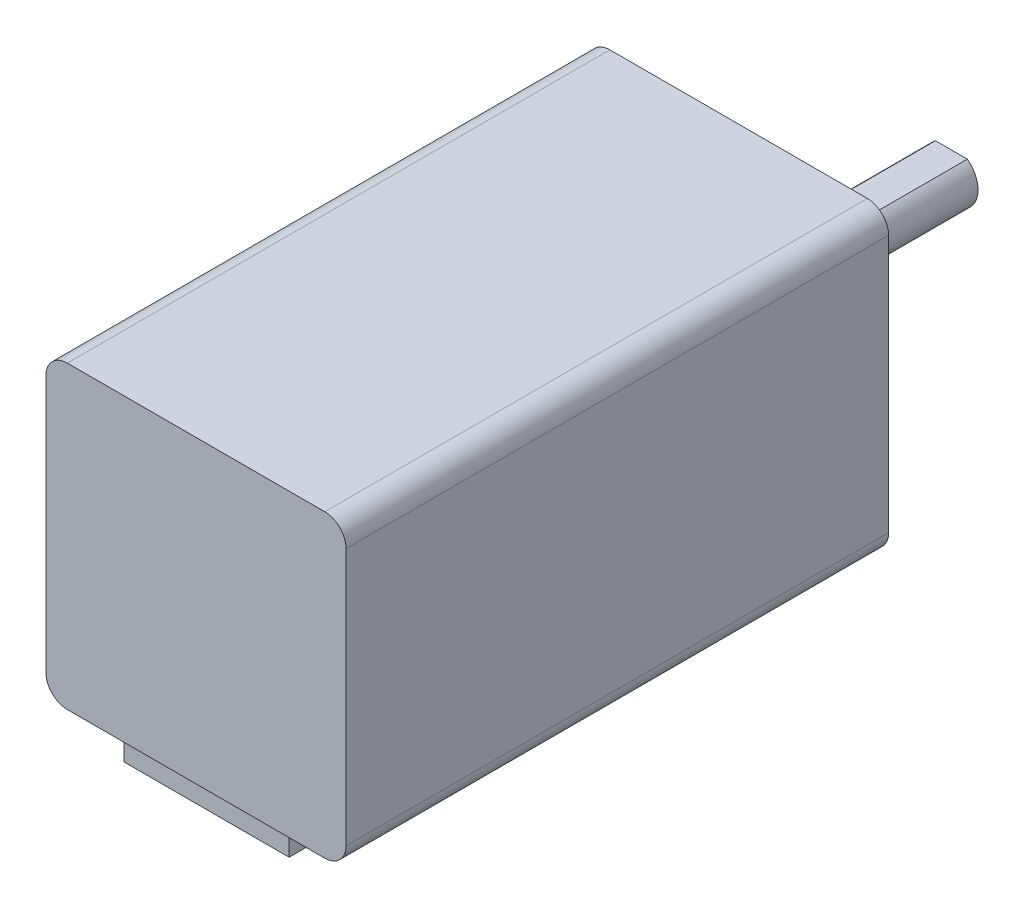
ISO-10303-21;
HEADER;
FILE_DESCRIPTION(('STEP AP214'),'2;1');
FILE_NAME('part.step','',(''),(''),'','','');
FILE_SCHEMA(('AUTOMOTIVE_DESIGN { 1 0 10303 214 1 1 1 1 }'));
ENDSEC;
DATA;
#1=APPLICATION_CONTEXT('core data for automotive mechanical design processes');
#2=APPLICATION_PROTOCOL_DEFINITION('international standard','automotive_design',2000,#1);
#3=PRODUCT_CONTEXT('',#1,'mechanical');
#4=PRODUCT('Part','Part','',(#3));
#5=PRODUCT_RELATED_PRODUCT_CATEGORY('part','',(#4));
#6=PRODUCT_DEFINITION_FORMATION('','',#4);
#7=PRODUCT_DEFINITION_CONTEXT('part definition',#1,'design');
#8=PRODUCT_DEFINITION('design','',#6,#7);
#9=PRODUCT_DEFINITION_SHAPE('','',#8);
#10=(LENGTH_UNIT() NAMED_UNIT(*) SI_UNIT(.MILLI.,.METRE.));
#11=(NAMED_UNIT(*) PLANE_ANGLE_UNIT() SI_UNIT($,.RADIAN.));
#12=(NAMED_UNIT(*) SI_UNIT($,.STERADIAN.) SOLID_ANGLE_UNIT());
#13=UNCERTAINTY_MEASURE_WITH_UNIT(LENGTH_MEASURE(1.E-05),#10,'distance_accuracy_value','');
#14=(GEOMETRIC_REPRESENTATION_CONTEXT(3) GLOBAL_UNCERTAINTY_ASSIGNED_CONTEXT((#13)) GLOBAL_UNIT_ASSIGNED_CONTEXT((#10,
#11,#12)) REPRESENTATION_CONTEXT('',''));
#15=CARTESIAN_POINT('',(0.,0.,0.));
#16=DIRECTION('',(0.,0.,1.));
#17=DIRECTION('',(1.,0.,0.));
#18=AXIS2_PLACEMENT_3D('',#15,#16,#17);
#19=CARTESIAN_POINT('',(-14.1,0.,51.));
#20=DIRECTION('',(-1.,0.,0.));
#21=DIRECTION('',(0.,0.,1.));
#22=AXIS2_PLACEMENT_3D('',#19,#20,#21);
#23=PLANE('',#22);
#24=DIRECTION('',(0.,1.,0.));
#25=VECTOR('',#24,1.);
#26=CARTESIAN_POINT('',(-14.1,0.,0.));
#27=LINE('',#26,#25);
#28=CARTESIAN_POINT('',(-14.1,-12.1,0.));
#29=VERTEX_POINT('',#28);
#30=CARTESIAN_POINT('',(-14.1,12.1,0.));
#31=VERTEX_POINT('',#30);
#32=EDGE_CURVE('E276',#29,#31,#27,.T.);
#33=ORIENTED_EDGE('',*,*,#32,.F.);
#34=DIRECTION('',(0.,0.,-1.));
#35=VECTOR('',#34,1.);
#36=CARTESIAN_POINT('',(-14.1,-12.1,51.));
#37=LINE('',#36,#35);
#38=CARTESIAN_POINT('',(-14.1,-12.1,51.));
#39=VERTEX_POINT('',#38);
#40=EDGE_CURVE('E307',#39,#29,#37,.T.);
#41=ORIENTED_EDGE('',*,*,#40,.F.);
#42=DIRECTION('',(0.,1.,0.));
#43=VECTOR('',#42,1.);
#44=CARTESIAN_POINT('',(-14.1,0.,51.));
#45=LINE('',#44,#43);
#46=CARTESIAN_POINT('',(-14.1,12.1,51.));
#47=VERTEX_POINT('',#46);
#48=EDGE_CURVE('E255',#39,#47,#45,.T.);
#49=ORIENTED_EDGE('',*,*,#48,.T.);
#50=DIRECTION('',(0.,0.,-1.));
#51=VECTOR('',#50,1.);
#52=CARTESIAN_POINT('',(-14.1,12.1,51.));
#53=LINE('',#52,#51);
#54=EDGE_CURVE('E76',#47,#31,#53,.T.);
#55=ORIENTED_EDGE('',*,*,#54,.T.);
#56=EDGE_LOOP('',(#33,#41,#49,#55));
#57=FACE_BOUND('',#56,.T.);
#58=ADVANCED_FACE('F68',(#57),#23,.T.);
#59=CARTESIAN_POINT('',(-12.1,-12.1,51.));
#60=DIRECTION('',(0.,0.,-1.));
#61=DIRECTION('',(-1.,0.,0.));
#62=AXIS2_PLACEMENT_3D('',#59,#60,#61);
#63=CYLINDRICAL_SURFACE('',#62,2.);
#64=CARTESIAN_POINT('',(-12.1,-12.1,0.));
#65=DIRECTION('',(0.,0.,1.));
#66=DIRECTION('',(1.,0.,0.));
#67=AXIS2_PLACEMENT_3D('',#64,#65,#66);
#68=CIRCLE('',#67,2.);
#69=CARTESIAN_POINT('',(-12.1,-14.1,0.));
#70=VERTEX_POINT('',#69);
#71=EDGE_CURVE('E279',#70,#29,#68,.F.);
#72=ORIENTED_EDGE('',*,*,#71,.F.);
#73=DIRECTION('',(0.,0.,-1.));
#74=VECTOR('',#73,1.);
#75=CARTESIAN_POINT('',(-12.1,-14.1,51.));
#76=LINE('',#75,#74);
#77=CARTESIAN_POINT('',(-12.1,-14.1,51.));
#78=VERTEX_POINT('',#77);
#79=EDGE_CURVE('E305',#78,#70,#76,.T.);
#80=ORIENTED_EDGE('',*,*,#79,.F.);
#81=CARTESIAN_POINT('',(-12.1,-12.1,51.));
#82=DIRECTION('',(0.,0.,1.));
#83=DIRECTION('',(1.,0.,0.));
#84=AXIS2_PLACEMENT_3D('',#81,#82,#83);
#85=CIRCLE('',#84,2.);
#86=EDGE_CURVE('E259',#78,#39,#85,.F.);
#87=ORIENTED_EDGE('',*,*,#86,.T.);
#88=ORIENTED_EDGE('',*,*,#40,.T.);
#89=EDGE_LOOP('',(#72,#80,#87,#88));
#90=FACE_BOUND('',#89,.T.);
#91=ADVANCED_FACE('F321',(#90),#63,.T.);
#92=CARTESIAN_POINT('',(0.,-14.1,51.));
#93=DIRECTION('',(0.,1.,0.));
#94=DIRECTION('',(0.,0.,1.));
#95=AXIS2_PLACEMENT_3D('',#92,#93,#94);
#96=PLANE('',#95);
#97=DIRECTION('',(0.,0.,-1.));
#98=VECTOR('',#97,1.);
#99=CARTESIAN_POINT('',(-7.75,-14.1,50.));
#100=LINE('',#99,#98);
#101=CARTESIAN_POINT('',(-7.75,-14.1,50.));
#102=VERTEX_POINT('',#101);
#103=CARTESIAN_POINT('',(-7.75,-14.1,44.));
#104=VERTEX_POINT('',#103);
#105=EDGE_CURVE('E83',#102,#104,#100,.T.);
#106=ORIENTED_EDGE('',*,*,#105,.F.);
#107=DIRECTION('',(-1.,0.,0.));
#108=VECTOR('',#107,1.);
#109=CARTESIAN_POINT('',(7.75,-14.1,50.));
#110=LINE('',#109,#108);
#111=CARTESIAN_POINT('',(7.75,-14.1,50.));
#112=VERTEX_POINT('',#111);
#113=EDGE_CURVE('E87',#112,#102,#110,.T.);
#114=ORIENTED_EDGE('',*,*,#113,.F.);
#115=DIRECTION('',(0.,0.,-1.));
#116=VECTOR('',#115,1.);
#117=CARTESIAN_POINT('',(7.75,-14.1,50.));
#118=LINE('',#117,#116);
#119=CARTESIAN_POINT('',(7.75,-14.1,44.));
#120=VERTEX_POINT('',#119);
#121=EDGE_CURVE('E203',#112,#120,#118,.T.);
#122=ORIENTED_EDGE('',*,*,#121,.T.);
#123=DIRECTION('',(-1.,0.,0.));
#124=VECTOR('',#123,1.);
#125=CARTESIAN_POINT('',(7.75,-14.1,44.));
#126=LINE('',#125,#124);
#127=EDGE_CURVE('E194',#120,#104,#126,.T.);
#128=ORIENTED_EDGE('',*,*,#127,.T.);
#129=EDGE_LOOP('',(#106,#114,#122,#128));
#130=FACE_BOUND('',#129,.T.);
#131=DIRECTION('',(1.,0.,0.));
#132=VECTOR('',#131,1.);
#133=CARTESIAN_POINT('',(0.,-14.1,0.));
#134=LINE('',#133,#132);
#135=CARTESIAN_POINT('',(12.1,-14.1,0.));
#136=VERTEX_POINT('',#135);
#137=EDGE_CURVE('E282',#70,#136,#134,.T.);
#138=ORIENTED_EDGE('',*,*,#137,.T.);
#139=DIRECTION('',(0.,0.,-1.));
#140=VECTOR('',#139,1.);
#141=CARTESIAN_POINT('',(12.1,-14.1,51.));
#142=LINE('',#141,#140);
#143=CARTESIAN_POINT('',(12.1,-14.1,51.));
#144=VERTEX_POINT('',#143);
#145=EDGE_CURVE('E302',#144,#136,#142,.T.);
#146=ORIENTED_EDGE('',*,*,#145,.F.);
#147=DIRECTION('',(1.,0.,0.));
#148=VECTOR('',#147,1.);
#149=CARTESIAN_POINT('',(0.,-14.1,51.));
#150=LINE('',#149,#148);
#151=EDGE_CURVE('E262',#78,#144,#150,.T.);
#152=ORIENTED_EDGE('',*,*,#151,.F.);
#153=ORIENTED_EDGE('',*,*,#79,.T.);
#154=EDGE_LOOP('',(#138,#146,#152,#153));
#155=FACE_BOUND('',#154,.T.);
#156=ADVANCED_FACE('F345',(#130,#155),#96,.F.);
#157=CARTESIAN_POINT('',(12.1,-12.1,51.));
#158=DIRECTION('',(0.,0.,-1.));
#159=DIRECTION('',(-1.,0.,0.));
#160=AXIS2_PLACEMENT_3D('',#157,#158,#159);
#161=CYLINDRICAL_SURFACE('',#160,2.);
#162=CARTESIAN_POINT('',(12.1,-12.1,0.));
#163=DIRECTION('',(0.,0.,1.));
#164=DIRECTION('',(1.,0.,0.));
#165=AXIS2_PLACEMENT_3D('',#162,#163,#164);
#166=CIRCLE('',#165,2.);
#167=CARTESIAN_POINT('',(14.1,-12.1,0.));
#168=VERTEX_POINT('',#167);
#169=EDGE_CURVE('E284',#136,#168,#166,.T.);
#170=ORIENTED_EDGE('',*,*,#169,.T.);
#171=DIRECTION('',(0.,0.,-1.));
#172=VECTOR('',#171,1.);
#173=CARTESIAN_POINT('',(14.1,-12.1,51.));
#174=LINE('',#173,#172);
#175=CARTESIAN_POINT('',(14.1,-12.1,51.));
#176=VERTEX_POINT('',#175);
#177=EDGE_CURVE('E299',#176,#168,#174,.T.);
#178=ORIENTED_EDGE('',*,*,#177,.F.);
#179=CARTESIAN_POINT('',(12.1,-12.1,51.));
#180=DIRECTION('',(0.,0.,1.));
#181=DIRECTION('',(1.,0.,0.));
#182=AXIS2_PLACEMENT_3D('',#179,#180,#181);
#183=CIRCLE('',#182,2.);
#184=EDGE_CURVE('E264',#144,#176,#183,.T.);
#185=ORIENTED_EDGE('',*,*,#184,.F.);
#186=ORIENTED_EDGE('',*,*,#145,.T.);
#187=EDGE_LOOP('',(#170,#178,#185,#186));
#188=FACE_BOUND('',#187,.T.);
#189=ADVANCED_FACE('F342',(#188),#161,.T.);
#190=CARTESIAN_POINT('',(14.1,0.,51.));
#191=DIRECTION('',(-1.,0.,0.));
#192=DIRECTION('',(0.,0.,1.));
#193=AXIS2_PLACEMENT_3D('',#190,#191,#192);
#194=PLANE('',#193);
#195=DIRECTION('',(0.,1.,0.));
#196=VECTOR('',#195,1.);
#197=CARTESIAN_POINT('',(14.1,0.,0.));
#198=LINE('',#197,#196);
#199=CARTESIAN_POINT('',(14.1,12.1,0.));
#200=VERTEX_POINT('',#199);
#201=EDGE_CURVE('E286',#168,#200,#198,.T.);
#202=ORIENTED_EDGE('',*,*,#201,.T.);
#203=DIRECTION('',(0.,0.,-1.));
#204=VECTOR('',#203,1.);
#205=CARTESIAN_POINT('',(14.1,12.1,51.));
#206=LINE('',#205,#204);
#207=CARTESIAN_POINT('',(14.1,12.1,51.));
#208=VERTEX_POINT('',#207);
#209=EDGE_CURVE('E296',#208,#200,#206,.T.);
#210=ORIENTED_EDGE('',*,*,#209,.F.);
#211=DIRECTION('',(0.,1.,0.));
#212=VECTOR('',#211,1.);
#213=CARTESIAN_POINT('',(14.1,0.,51.));
#214=LINE('',#213,#212);
#215=EDGE_CURVE('E266',#176,#208,#214,.T.);
#216=ORIENTED_EDGE('',*,*,#215,.F.);
#217=ORIENTED_EDGE('',*,*,#177,.T.);
#218=EDGE_LOOP('',(#202,#210,#216,#217));
#219=FACE_BOUND('',#218,.T.);
#220=ADVANCED_FACE('F338',(#219),#194,.F.);
#221=CARTESIAN_POINT('',(12.1,12.1,51.));
#222=DIRECTION('',(0.,0.,-1.));
#223=DIRECTION('',(-1.,0.,0.));
#224=AXIS2_PLACEMENT_3D('',#221,#222,#223);
#225=CYLINDRICAL_SURFACE('',#224,2.);
#226=CARTESIAN_POINT('',(12.1,12.1,0.));
#227=DIRECTION('',(0.,0.,1.));
#228=DIRECTION('',(1.,0.,0.));
#229=AXIS2_PLACEMENT_3D('',#226,#227,#228);
#230=CIRCLE('',#229,2.);
#231=CARTESIAN_POINT('',(12.1,14.1,0.));
#232=VERTEX_POINT('',#231);
#233=EDGE_CURVE('E288',#200,#232,#230,.T.);
#234=ORIENTED_EDGE('',*,*,#233,.T.);
#235=DIRECTION('',(0.,0.,-1.));
#236=VECTOR('',#235,1.);
#237=CARTESIAN_POINT('',(12.1,14.1,51.));
#238=LINE('',#237,#236);
#239=CARTESIAN_POINT('',(12.1,14.1,51.));
#240=VERTEX_POINT('',#239);
#241=EDGE_CURVE('E294',#240,#232,#238,.T.);
#242=ORIENTED_EDGE('',*,*,#241,.F.);
#243=CARTESIAN_POINT('',(12.1,12.1,51.));
#244=DIRECTION('',(0.,0.,1.));
#245=DIRECTION('',(1.,0.,0.));
#246=AXIS2_PLACEMENT_3D('',#243,#244,#245);
#247=CIRCLE('',#246,2.);
#248=EDGE_CURVE('E268',#208,#240,#247,.T.);
#249=ORIENTED_EDGE('',*,*,#248,.F.);
#250=ORIENTED_EDGE('',*,*,#209,.T.);
#251=EDGE_LOOP('',(#234,#242,#249,#250));
#252=FACE_BOUND('',#251,.T.);
#253=ADVANCED_FACE('F334',(#252),#225,.T.);
#254=CARTESIAN_POINT('',(0.,14.1,51.));
#255=DIRECTION('',(0.,1.,0.));
#256=DIRECTION('',(0.,0.,1.));
#257=AXIS2_PLACEMENT_3D('',#254,#255,#256);
#258=PLANE('',#257);
#259=DIRECTION('',(1.,0.,0.));
#260=VECTOR('',#259,1.);
#261=CARTESIAN_POINT('',(0.,14.1,0.));
#262=LINE('',#261,#260);
#263=CARTESIAN_POINT('',(-12.1,14.1,0.));
#264=VERTEX_POINT('',#263);
#265=EDGE_CURVE('E256',#264,#232,#262,.T.);
#266=ORIENTED_EDGE('',*,*,#265,.F.);
#267=DIRECTION('',(0.,0.,-1.));
#268=VECTOR('',#267,1.);
#269=CARTESIAN_POINT('',(-12.1,14.1,51.));
#270=LINE('',#269,#268);
#271=CARTESIAN_POINT('',(-12.1,14.1,51.));
#272=VERTEX_POINT('',#271);
#273=EDGE_CURVE('E273',#272,#264,#270,.T.);
#274=ORIENTED_EDGE('',*,*,#273,.F.);
#275=DIRECTION('',(1.,0.,0.));
#276=VECTOR('',#275,1.);
#277=CARTESIAN_POINT('',(0.,14.1,51.));
#278=LINE('',#277,#276);
#279=EDGE_CURVE('E270',#272,#240,#278,.T.);
#280=ORIENTED_EDGE('',*,*,#279,.T.);
#281=ORIENTED_EDGE('',*,*,#241,.T.);
#282=EDGE_LOOP('',(#266,#274,#280,#281));
#283=FACE_BOUND('',#282,.T.);
#284=ADVANCED_FACE('F330',(#283),#258,.T.);
#285=CARTESIAN_POINT('',(-12.1,12.1,51.));
#286=DIRECTION('',(0.,0.,-1.));
#287=DIRECTION('',(-1.,0.,0.));
#288=AXIS2_PLACEMENT_3D('',#285,#286,#287);
#289=CYLINDRICAL_SURFACE('',#288,2.);
#290=CARTESIAN_POINT('',(-12.1,12.1,0.));
#291=DIRECTION('',(0.,0.,1.));
#292=DIRECTION('',(1.,0.,0.));
#293=AXIS2_PLACEMENT_3D('',#290,#291,#292);
#294=CIRCLE('',#293,2.);
#295=EDGE_CURVE('E251',#31,#264,#294,.F.);
#296=ORIENTED_EDGE('',*,*,#295,.F.);
#297=ORIENTED_EDGE('',*,*,#54,.F.);
#298=CARTESIAN_POINT('',(-12.1,12.1,51.));
#299=DIRECTION('',(0.,0.,1.));
#300=DIRECTION('',(1.,0.,0.));
#301=AXIS2_PLACEMENT_3D('',#298,#299,#300);
#302=CIRCLE('',#301,2.);
#303=EDGE_CURVE('E252',#47,#272,#302,.F.);
#304=ORIENTED_EDGE('',*,*,#303,.T.);
#305=ORIENTED_EDGE('',*,*,#273,.T.);
#306=EDGE_LOOP('',(#296,#297,#304,#305));
#307=FACE_BOUND('',#306,.T.);
#308=ADVANCED_FACE('F70',(#307),#289,.T.);
#309=CARTESIAN_POINT('',(0.,0.,0.));
#310=DIRECTION('',(0.,0.,1.));
#311=DIRECTION('',(1.,0.,0.));
#312=AXIS2_PLACEMENT_3D('',#309,#310,#311);
#313=PLANE('',#312);
#314=CARTESIAN_POINT('',(0.,0.,0.));
#315=DIRECTION('',(0.,0.,1.));
#316=DIRECTION('',(1.,0.,0.));
#317=AXIS2_PLACEMENT_3D('',#314,#315,#316);
#318=CIRCLE('',#317,11.);
#319=CARTESIAN_POINT('',(11.,0.,0.));
#320=VERTEX_POINT('',#319);
#321=EDGE_CURVE('E221',#320,#320,#318,.T.);
#322=ORIENTED_EDGE('',*,*,#321,.T.);
#323=EDGE_LOOP('',(#322));
#324=FACE_BOUND('',#323,.T.);
#325=CARTESIAN_POINT('',(11.5,11.5,0.));
#326=DIRECTION('',(0.,0.,-1.));
#327=DIRECTION('',(-1.,0.,0.));
#328=AXIS2_PLACEMENT_3D('',#325,#326,#327);
#329=CIRCLE('',#328,1.02499999999999);
#330=CARTESIAN_POINT('',(10.475,11.5,0.));
#331=VERTEX_POINT('',#330);
#332=EDGE_CURVE('E225',#331,#331,#329,.T.);
#333=ORIENTED_EDGE('',*,*,#332,.F.);
#334=EDGE_LOOP('',(#333));
#335=FACE_BOUND('',#334,.T.);
#336=CARTESIAN_POINT('',(-11.5,11.5,0.));
#337=DIRECTION('',(0.,0.,-1.));
#338=DIRECTION('',(-1.,0.,0.));
#339=AXIS2_PLACEMENT_3D('',#336,#337,#338);
#340=CIRCLE('',#339,1.02499999999999);
#341=CARTESIAN_POINT('',(-12.525,11.5,0.));
#342=VERTEX_POINT('',#341);
#343=EDGE_CURVE('E233',#342,#342,#340,.T.);
#344=ORIENTED_EDGE('',*,*,#343,.F.);
#345=EDGE_LOOP('',(#344));
#346=FACE_BOUND('',#345,.T.);
#347=CARTESIAN_POINT('',(-11.5,-11.5,0.));
#348=DIRECTION('',(0.,0.,-1.));
#349=DIRECTION('',(-1.,0.,0.));
#350=AXIS2_PLACEMENT_3D('',#347,#348,#349);
#351=CIRCLE('',#350,1.02499999999999);
#352=CARTESIAN_POINT('',(-12.525,-11.5,0.));
#353=VERTEX_POINT('',#352);
#354=EDGE_CURVE('E239',#353,#353,#351,.T.);
#355=ORIENTED_EDGE('',*,*,#354,.F.);
#356=EDGE_LOOP('',(#355));
#357=FACE_BOUND('',#356,.T.);
#358=CARTESIAN_POINT('',(11.5,-11.5,0.));
#359=DIRECTION('',(0.,0.,-1.));
#360=DIRECTION('',(-1.,0.,0.));
#361=AXIS2_PLACEMENT_3D('',#358,#359,#360);
#362=CIRCLE('',#361,1.02499999999999);
#363=CARTESIAN_POINT('',(10.475,-11.5,0.));
#364=VERTEX_POINT('',#363);
#365=EDGE_CURVE('E245',#364,#364,#362,.T.);
#366=ORIENTED_EDGE('',*,*,#365,.F.);
#367=EDGE_LOOP('',(#366));
#368=FACE_BOUND('',#367,.T.);
#369=ORIENTED_EDGE('',*,*,#295,.T.);
#370=ORIENTED_EDGE('',*,*,#265,.T.);
#371=ORIENTED_EDGE('',*,*,#233,.F.);
#372=ORIENTED_EDGE('',*,*,#201,.F.);
#373=ORIENTED_EDGE('',*,*,#169,.F.);
#374=ORIENTED_EDGE('',*,*,#137,.F.);
#375=ORIENTED_EDGE('',*,*,#71,.T.);
#376=ORIENTED_EDGE('',*,*,#32,.T.);
#377=EDGE_LOOP('',(#369,#370,#371,#372,#373,#374,#375,#376));
#378=FACE_BOUND('',#377,.T.);
#379=ADVANCED_FACE('F316',(#324,#335,#346,#357,#368,#378),#313,.F.);
#380=CARTESIAN_POINT('',(0.,0.,51.));
#381=DIRECTION('',(0.,0.,1.));
#382=DIRECTION('',(1.,0.,0.));
#383=AXIS2_PLACEMENT_3D('',#380,#381,#382);
#384=PLANE('',#383);
#385=ORIENTED_EDGE('',*,*,#303,.F.);
#386=ORIENTED_EDGE('',*,*,#48,.F.);
#387=ORIENTED_EDGE('',*,*,#86,.F.);
#388=ORIENTED_EDGE('',*,*,#151,.T.);
#389=ORIENTED_EDGE('',*,*,#184,.T.);
#390=ORIENTED_EDGE('',*,*,#215,.T.);
#391=ORIENTED_EDGE('',*,*,#248,.T.);
#392=ORIENTED_EDGE('',*,*,#279,.F.);
#393=EDGE_LOOP('',(#385,#386,#387,#388,#389,#390,#391,#392));
#394=FACE_BOUND('',#393,.T.);
#395=ADVANCED_FACE('F325',(#394),#384,.T.);
#396=CARTESIAN_POINT('',(11.5,-11.5,4.75));
#397=DIRECTION('',(0.,0.,-1.));
#398=DIRECTION('',(-1.,0.,0.));
#399=AXIS2_PLACEMENT_3D('',#396,#397,#398);
#400=CONICAL_SURFACE('',#399,1.02499999999999,1.02974425867665);
#401=CARTESIAN_POINT('',(11.5,-11.5,5.36588213450325));
#402=VERTEX_POINT('',#401);
#403=VERTEX_LOOP('',#402);
#404=FACE_BOUND('',#403,.T.);
#405=CARTESIAN_POINT('',(11.5,-11.5,4.75));
#406=DIRECTION('',(0.,0.,-1.));
#407=DIRECTION('',(-1.,0.,0.));
#408=AXIS2_PLACEMENT_3D('',#405,#406,#407);
#409=CIRCLE('',#408,1.02499999999999);
#410=CARTESIAN_POINT('',(10.475,-11.5,4.75));
#411=VERTEX_POINT('',#410);
#412=EDGE_CURVE('E248',#411,#411,#409,.T.);
#413=ORIENTED_EDGE('',*,*,#412,.T.);
#414=EDGE_LOOP('',(#413));
#415=FACE_BOUND('',#414,.T.);
#416=ADVANCED_FACE('F410',(#404,#415),#400,.F.);
#417=CARTESIAN_POINT('',(11.5,-11.5,0.));
#418=DIRECTION('',(0.,0.,-1.));
#419=DIRECTION('',(-1.,0.,0.));
#420=AXIS2_PLACEMENT_3D('',#417,#418,#419);
#421=CYLINDRICAL_SURFACE('',#420,1.02499999999999);
#422=ORIENTED_EDGE('',*,*,#412,.F.);
#423=EDGE_LOOP('',(#422));
#424=FACE_BOUND('',#423,.T.);
#425=ORIENTED_EDGE('',*,*,#365,.T.);
#426=EDGE_LOOP('',(#425));
#427=FACE_BOUND('',#426,.T.);
#428=ADVANCED_FACE('F419',(#424,#427),#421,.F.);
#429=CARTESIAN_POINT('',(-11.5,-11.5,4.75));
#430=DIRECTION('',(0.,0.,-1.));
#431=DIRECTION('',(-1.,0.,0.));
#432=AXIS2_PLACEMENT_3D('',#429,#430,#431);
#433=CONICAL_SURFACE('',#432,1.02499999999999,1.02974425867665);
#434=CARTESIAN_POINT('',(-11.5,-11.5,5.36588213450325));
#435=VERTEX_POINT('',#434);
#436=VERTEX_LOOP('',#435);
#437=FACE_BOUND('',#436,.T.);
#438=CARTESIAN_POINT('',(-11.5,-11.5,4.75));
#439=DIRECTION('',(0.,0.,-1.));
#440=DIRECTION('',(-1.,0.,0.));
#441=AXIS2_PLACEMENT_3D('',#438,#439,#440);
#442=CIRCLE('',#441,1.02499999999999);
#443=CARTESIAN_POINT('',(-12.525,-11.5,4.75));
#444=VERTEX_POINT('',#443);
#445=EDGE_CURVE('E242',#444,#444,#442,.T.);
#446=ORIENTED_EDGE('',*,*,#445,.T.);
#447=EDGE_LOOP('',(#446));
#448=FACE_BOUND('',#447,.T.);
#449=ADVANCED_FACE('F430',(#437,#448),#433,.F.);
#450=CARTESIAN_POINT('',(-11.5,-11.5,0.));
#451=DIRECTION('',(0.,0.,-1.));
#452=DIRECTION('',(-1.,0.,0.));
#453=AXIS2_PLACEMENT_3D('',#450,#451,#452);
#454=CYLINDRICAL_SURFACE('',#453,1.02499999999999);
#455=ORIENTED_EDGE('',*,*,#445,.F.);
#456=EDGE_LOOP('',(#455));
#457=FACE_BOUND('',#456,.T.);
#458=ORIENTED_EDGE('',*,*,#354,.T.);
#459=EDGE_LOOP('',(#458));
#460=FACE_BOUND('',#459,.T.);
#461=ADVANCED_FACE('F442',(#457,#460),#454,.F.);
#462=CARTESIAN_POINT('',(-11.5,11.5,4.75));
#463=DIRECTION('',(0.,0.,-1.));
#464=DIRECTION('',(-1.,0.,0.));
#465=AXIS2_PLACEMENT_3D('',#462,#463,#464);
#466=CONICAL_SURFACE('',#465,1.02499999999999,1.02974425867665);
#467=CARTESIAN_POINT('',(-11.5,11.5,5.36588213450325));
#468=VERTEX_POINT('',#467);
#469=VERTEX_LOOP('',#468);
#470=FACE_BOUND('',#469,.T.);
#471=CARTESIAN_POINT('',(-11.5,11.5,4.75));
#472=DIRECTION('',(0.,0.,-1.));
#473=DIRECTION('',(-1.,0.,0.));
#474=AXIS2_PLACEMENT_3D('',#471,#472,#473);
#475=CIRCLE('',#474,1.02499999999999);
#476=CARTESIAN_POINT('',(-12.525,11.5,4.75));
#477=VERTEX_POINT('',#476);
#478=EDGE_CURVE('E236',#477,#477,#475,.T.);
#479=ORIENTED_EDGE('',*,*,#478,.T.);
#480=EDGE_LOOP('',(#479));
#481=FACE_BOUND('',#480,.T.);
#482=ADVANCED_FACE('F452',(#470,#481),#466,.F.);
#483=CARTESIAN_POINT('',(-11.5,11.5,0.));
#484=DIRECTION('',(0.,0.,-1.));
#485=DIRECTION('',(-1.,0.,0.));
#486=AXIS2_PLACEMENT_3D('',#483,#484,#485);
#487=CYLINDRICAL_SURFACE('',#486,1.02499999999999);
#488=ORIENTED_EDGE('',*,*,#478,.F.);
#489=EDGE_LOOP('',(#488));
#490=FACE_BOUND('',#489,.T.);
#491=ORIENTED_EDGE('',*,*,#343,.T.);
#492=EDGE_LOOP('',(#491));
#493=FACE_BOUND('',#492,.T.);
#494=ADVANCED_FACE('F464',(#490,#493),#487,.F.);
#495=CARTESIAN_POINT('',(11.5,11.5,4.75));
#496=DIRECTION('',(0.,0.,-1.));
#497=DIRECTION('',(-1.,0.,0.));
#498=AXIS2_PLACEMENT_3D('',#495,#496,#497);
#499=CONICAL_SURFACE('',#498,1.02499999999999,1.02974425867665);
#500=CARTESIAN_POINT('',(11.5,11.5,5.36588213450325));
#501=VERTEX_POINT('',#500);
#502=VERTEX_LOOP('',#501);
#503=FACE_BOUND('',#502,.T.);
#504=CARTESIAN_POINT('',(11.5,11.5,4.75));
#505=DIRECTION('',(0.,0.,-1.));
#506=DIRECTION('',(-1.,0.,0.));
#507=AXIS2_PLACEMENT_3D('',#504,#505,#506);
#508=CIRCLE('',#507,1.02499999999999);
#509=CARTESIAN_POINT('',(10.475,11.5,4.75));
#510=VERTEX_POINT('',#509);
#511=EDGE_CURVE('E230',#510,#510,#508,.T.);
#512=ORIENTED_EDGE('',*,*,#511,.T.);
#513=EDGE_LOOP('',(#512));
#514=FACE_BOUND('',#513,.T.);
#515=ADVANCED_FACE('F474',(#503,#514),#499,.F.);
#516=CARTESIAN_POINT('',(11.5,11.5,0.));
#517=DIRECTION('',(0.,0.,-1.));
#518=DIRECTION('',(-1.,0.,0.));
#519=AXIS2_PLACEMENT_3D('',#516,#517,#518);
#520=CYLINDRICAL_SURFACE('',#519,1.02499999999999);
#521=ORIENTED_EDGE('',*,*,#511,.F.);
#522=EDGE_LOOP('',(#521));
#523=FACE_BOUND('',#522,.T.);
#524=ORIENTED_EDGE('',*,*,#332,.T.);
#525=EDGE_LOOP('',(#524));
#526=FACE_BOUND('',#525,.T.);
#527=ADVANCED_FACE('F486',(#523,#526),#520,.F.);
#528=CARTESIAN_POINT('',(0.,0.,-2.));
#529=DIRECTION('',(0.,0.,1.));
#530=DIRECTION('',(1.,0.,0.));
#531=AXIS2_PLACEMENT_3D('',#528,#529,#530);
#532=CYLINDRICAL_SURFACE('',#531,11.);
#533=CARTESIAN_POINT('',(0.,0.,-2.));
#534=DIRECTION('',(0.,0.,1.));
#535=DIRECTION('',(1.,0.,0.));
#536=AXIS2_PLACEMENT_3D('',#533,#534,#535);
#537=CIRCLE('',#536,11.);
#538=CARTESIAN_POINT('',(11.,0.,-2.));
#539=VERTEX_POINT('',#538);
#540=EDGE_CURVE('E222',#539,#539,#537,.T.);
#541=ORIENTED_EDGE('',*,*,#540,.T.);
#542=EDGE_LOOP('',(#541));
#543=FACE_BOUND('',#542,.T.);
#544=ORIENTED_EDGE('',*,*,#321,.F.);
#545=EDGE_LOOP('',(#544));
#546=FACE_BOUND('',#545,.T.);
#547=ADVANCED_FACE('F496',(#543,#546),#532,.T.);
#548=CARTESIAN_POINT('',(0.,0.,-2.));
#549=DIRECTION('',(0.,0.,1.));
#550=DIRECTION('',(1.,0.,0.));
#551=AXIS2_PLACEMENT_3D('',#548,#549,#550);
#552=PLANE('',#551);
#553=CARTESIAN_POINT('',(0.,0.,-2.));
#554=DIRECTION('',(0.,0.,1.));
#555=DIRECTION('',(1.,0.,0.));
#556=AXIS2_PLACEMENT_3D('',#553,#554,#555);
#557=CIRCLE('',#556,2.5);
#558=CARTESIAN_POINT('',(2.5,0.,-2.));
#559=VERTEX_POINT('',#558);
#560=EDGE_CURVE('E218',#559,#559,#557,.T.);
#561=ORIENTED_EDGE('',*,*,#560,.T.);
#562=EDGE_LOOP('',(#561));
#563=FACE_BOUND('',#562,.T.);
#564=ORIENTED_EDGE('',*,*,#540,.F.);
#565=EDGE_LOOP('',(#564));
#566=FACE_BOUND('',#565,.T.);
#567=ADVANCED_FACE('F514',(#563,#566),#552,.F.);
#568=CARTESIAN_POINT('',(0.,0.,-20.));
#569=DIRECTION('',(0.,0.,1.));
#570=DIRECTION('',(1.,0.,0.));
#571=AXIS2_PLACEMENT_3D('',#568,#569,#570);
#572=CYLINDRICAL_SURFACE('',#571,2.5);
#573=DIRECTION('',(0.,0.,-1.));
#574=VECTOR('',#573,1.);
#575=CARTESIAN_POINT('',(-1.49999999999999,2.,-20.));
#576=LINE('',#575,#574);
#577=CARTESIAN_POINT('',(-1.49999999999999,2.,-5.));
#578=VERTEX_POINT('',#577);
#579=CARTESIAN_POINT('',(-1.49999999999999,2.,-20.));
#580=VERTEX_POINT('',#579);
#581=EDGE_CURVE('E201',#578,#580,#576,.T.);
#582=ORIENTED_EDGE('',*,*,#581,.T.);
#583=CARTESIAN_POINT('',(0.,0.,-20.));
#584=DIRECTION('',(0.,0.,1.));
#585=DIRECTION('',(1.,0.,0.));
#586=AXIS2_PLACEMENT_3D('',#583,#584,#585);
#587=CIRCLE('',#586,2.5);
#588=CARTESIAN_POINT('',(1.49999999999999,2.00000000000001,-20.));
#589=VERTEX_POINT('',#588);
#590=EDGE_CURVE('E213',#580,#589,#587,.T.);
#591=ORIENTED_EDGE('',*,*,#590,.T.);
#592=DIRECTION('',(0.,0.,-1.));
#593=VECTOR('',#592,1.);
#594=CARTESIAN_POINT('',(1.49999999999999,2.,-20.));
#595=LINE('',#594,#593);
#596=CARTESIAN_POINT('',(1.49999999999999,2.,-5.));
#597=VERTEX_POINT('',#596);
#598=EDGE_CURVE('E199',#597,#589,#595,.T.);
#599=ORIENTED_EDGE('',*,*,#598,.F.);
#600=CARTESIAN_POINT('',(0.,0.,-5.));
#601=DIRECTION('',(0.,0.,1.));
#602=DIRECTION('',(1.,0.,0.));
#603=AXIS2_PLACEMENT_3D('',#600,#601,#602);
#604=CIRCLE('',#603,2.5);
#605=EDGE_CURVE('E12',#578,#597,#604,.F.);
#606=ORIENTED_EDGE('',*,*,#605,.F.);
#607=EDGE_LOOP('',(#582,#591,#599,#606));
#608=FACE_BOUND('',#607,.T.);
#609=ORIENTED_EDGE('',*,*,#560,.F.);
#610=EDGE_LOOP('',(#609));
#611=FACE_BOUND('',#610,.T.);
#612=ADVANCED_FACE('F524',(#608,#611),#572,.T.);
#613=CARTESIAN_POINT('',(0.,0.,-20.));
#614=DIRECTION('',(0.,0.,1.));
#615=DIRECTION('',(1.,0.,0.));
#616=AXIS2_PLACEMENT_3D('',#613,#614,#615);
#617=PLANE('',#616);
#618=ORIENTED_EDGE('',*,*,#590,.F.);
#619=DIRECTION('',(1.,0.,0.));
#620=VECTOR('',#619,1.);
#621=CARTESIAN_POINT('',(-1.49999999999999,2.,-20.));
#622=LINE('',#621,#620);
#623=EDGE_CURVE('E210',#580,#589,#622,.T.);
#624=ORIENTED_EDGE('',*,*,#623,.T.);
#625=EDGE_LOOP('',(#618,#624));
#626=FACE_BOUND('',#625,.T.);
#627=ADVANCED_FACE('F534',(#626),#617,.F.);
#628=CARTESIAN_POINT('',(-1.49999999999999,2.,-20.));
#629=DIRECTION('',(0.,-1.,0.));
#630=DIRECTION('',(0.,0.,-1.));
#631=AXIS2_PLACEMENT_3D('',#628,#629,#630);
#632=PLANE('',#631);
#633=ORIENTED_EDGE('',*,*,#598,.T.);
#634=ORIENTED_EDGE('',*,*,#623,.F.);
#635=ORIENTED_EDGE('',*,*,#581,.F.);
#636=DIRECTION('',(1.,0.,0.));
#637=VECTOR('',#636,1.);
#638=CARTESIAN_POINT('',(-1.49999999999999,2.,-5.));
#639=LINE('',#638,#637);
#640=EDGE_CURVE('E208',#578,#597,#639,.T.);
#641=ORIENTED_EDGE('',*,*,#640,.T.);
#642=EDGE_LOOP('',(#633,#634,#635,#641));
#643=FACE_BOUND('',#642,.T.);
#644=ADVANCED_FACE('F544',(#643),#632,.F.);
#645=CARTESIAN_POINT('',(-1.49999999999999,2.,-5.));
#646=DIRECTION('',(0.,0.,1.));
#647=DIRECTION('',(1.,0.,0.));
#648=AXIS2_PLACEMENT_3D('',#645,#646,#647);
#649=PLANE('',#648);
#650=ORIENTED_EDGE('',*,*,#640,.F.);
#651=ORIENTED_EDGE('',*,*,#605,.T.);
#652=EDGE_LOOP('',(#650,#651));
#653=FACE_BOUND('',#652,.T.);
#654=ADVANCED_FACE('F554',(#653),#649,.F.);
#655=CARTESIAN_POINT('',(-7.75,-14.1,50.));
#656=DIRECTION('',(1.,0.,0.));
#657=DIRECTION('',(0.,0.,-1.));
#658=AXIS2_PLACEMENT_3D('',#655,#656,#657);
#659=PLANE('',#658);
#660=DIRECTION('',(0.,-1.,0.));
#661=VECTOR('',#660,1.);
#662=CARTESIAN_POINT('',(-7.75,-14.1,44.));
#663=LINE('',#662,#661);
#664=CARTESIAN_POINT('',(-7.75,-16.7,44.));
#665=VERTEX_POINT('',#664);
#666=EDGE_CURVE('E198',#104,#665,#663,.T.);
#667=ORIENTED_EDGE('',*,*,#666,.T.);
#668=DIRECTION('',(0.,0.,-1.));
#669=VECTOR('',#668,1.);
#670=CARTESIAN_POINT('',(-7.75,-16.7,50.));
#671=LINE('',#670,#669);
#672=CARTESIAN_POINT('',(-7.75,-16.7,50.));
#673=VERTEX_POINT('',#672);
#674=EDGE_CURVE('E182',#673,#665,#671,.T.);
#675=ORIENTED_EDGE('',*,*,#674,.F.);
#676=DIRECTION('',(0.,-1.,0.));
#677=VECTOR('',#676,1.);
#678=CARTESIAN_POINT('',(-7.75,-14.1,50.));
#679=LINE('',#678,#677);
#680=EDGE_CURVE('E189',#102,#673,#679,.T.);
#681=ORIENTED_EDGE('',*,*,#680,.F.);
#682=ORIENTED_EDGE('',*,*,#105,.T.);
#683=EDGE_LOOP('',(#667,#675,#681,#682));
#684=FACE_BOUND('',#683,.T.);
#685=ADVANCED_FACE('F196',(#684),#659,.F.);
#686=CARTESIAN_POINT('',(-7.75,-16.7,50.));
#687=DIRECTION('',(0.,1.,0.));
#688=DIRECTION('',(0.,0.,1.));
#689=AXIS2_PLACEMENT_3D('',#686,#687,#688);
#690=PLANE('',#689);
#691=DIRECTION('',(1.,0.,0.));
#692=VECTOR('',#691,1.);
#693=CARTESIAN_POINT('',(-7.75,-16.7,44.));
#694=LINE('',#693,#692);
#695=CARTESIAN_POINT('',(7.75,-16.7,44.));
#696=VERTEX_POINT('',#695);
#697=EDGE_CURVE('E617',#665,#696,#694,.T.);
#698=ORIENTED_EDGE('',*,*,#697,.T.);
#699=DIRECTION('',(0.,0.,-1.));
#700=VECTOR('',#699,1.);
#701=CARTESIAN_POINT('',(7.75,-16.7,50.));
#702=LINE('',#701,#700);
#703=CARTESIAN_POINT('',(7.75,-16.7,50.));
#704=VERTEX_POINT('',#703);
#705=EDGE_CURVE('E185',#704,#696,#702,.T.);
#706=ORIENTED_EDGE('',*,*,#705,.F.);
#707=DIRECTION('',(1.,0.,0.));
#708=VECTOR('',#707,1.);
#709=CARTESIAN_POINT('',(-7.75,-16.7,50.));
#710=LINE('',#709,#708);
#711=EDGE_CURVE('E178',#673,#704,#710,.T.);
#712=ORIENTED_EDGE('',*,*,#711,.F.);
#713=ORIENTED_EDGE('',*,*,#674,.T.);
#714=EDGE_LOOP('',(#698,#706,#712,#713));
#715=FACE_BOUND('',#714,.T.);
#716=ADVANCED_FACE('F180',(#715),#690,.F.);
#717=CARTESIAN_POINT('',(7.75,-14.1,50.));
#718=DIRECTION('',(-1.,0.,0.));
#719=DIRECTION('',(0.,0.,1.));
#720=AXIS2_PLACEMENT_3D('',#717,#718,#719);
#721=PLANE('',#720);
#722=DIRECTION('',(0.,1.,0.));
#723=VECTOR('',#722,1.);
#724=CARTESIAN_POINT('',(7.75,-14.1,44.));
#725=LINE('',#724,#723);
#726=EDGE_CURVE('E619',#696,#120,#725,.T.);
#727=ORIENTED_EDGE('',*,*,#726,.T.);
#728=ORIENTED_EDGE('',*,*,#121,.F.);
#729=DIRECTION('',(0.,1.,0.));
#730=VECTOR('',#729,1.);
#731=CARTESIAN_POINT('',(7.75,-14.1,50.));
#732=LINE('',#731,#730);
#733=EDGE_CURVE('E188',#704,#112,#732,.T.);
#734=ORIENTED_EDGE('',*,*,#733,.F.);
#735=ORIENTED_EDGE('',*,*,#705,.T.);
#736=EDGE_LOOP('',(#727,#728,#734,#735));
#737=FACE_BOUND('',#736,.T.);
#738=ADVANCED_FACE('F584',(#737),#721,.F.);
#739=CARTESIAN_POINT('',(0.,0.,50.));
#740=DIRECTION('',(0.,0.,1.));
#741=DIRECTION('',(1.,0.,0.));
#742=AXIS2_PLACEMENT_3D('',#739,#740,#741);
#743=PLANE('',#742);
#744=ORIENTED_EDGE('',*,*,#680,.T.);
#745=ORIENTED_EDGE('',*,*,#711,.T.);
#746=ORIENTED_EDGE('',*,*,#733,.T.);
#747=ORIENTED_EDGE('',*,*,#113,.T.);
#748=EDGE_LOOP('',(#744,#745,#746,#747));
#749=FACE_BOUND('',#748,.T.);
#750=ADVANCED_FACE('F192',(#749),#743,.T.);
#751=CARTESIAN_POINT('',(0.,0.,44.));
#752=DIRECTION('',(0.,0.,1.));
#753=DIRECTION('',(1.,0.,0.));
#754=AXIS2_PLACEMENT_3D('',#751,#752,#753);
#755=PLANE('',#754);
#756=ORIENTED_EDGE('',*,*,#666,.F.);
#757=ORIENTED_EDGE('',*,*,#127,.F.);
#758=ORIENTED_EDGE('',*,*,#726,.F.);
#759=ORIENTED_EDGE('',*,*,#697,.F.);
#760=EDGE_LOOP('',(#756,#757,#758,#759));
#761=FACE_BOUND('',#760,.T.);
#762=ADVANCED_FACE('F602',(#761),#755,.F.);
#763=CLOSED_SHELL('',(#58,#91,#156,#189,#220,#253,#284,#308,#379,#395,#416,#428,#449,#461,#482,
#494,#515,#527,#547,#567,#612,#627,#644,#654,#685,#716,#738,#750,#762));
#764=MANIFOLD_SOLID_BREP('B2',#763);
#765=ADVANCED_BREP_SHAPE_REPRESENTATION('',(#18,#764),#14);
#766=SHAPE_DEFINITION_REPRESENTATION(#9,#765);
ENDSEC;
END-ISO-10303-21;
